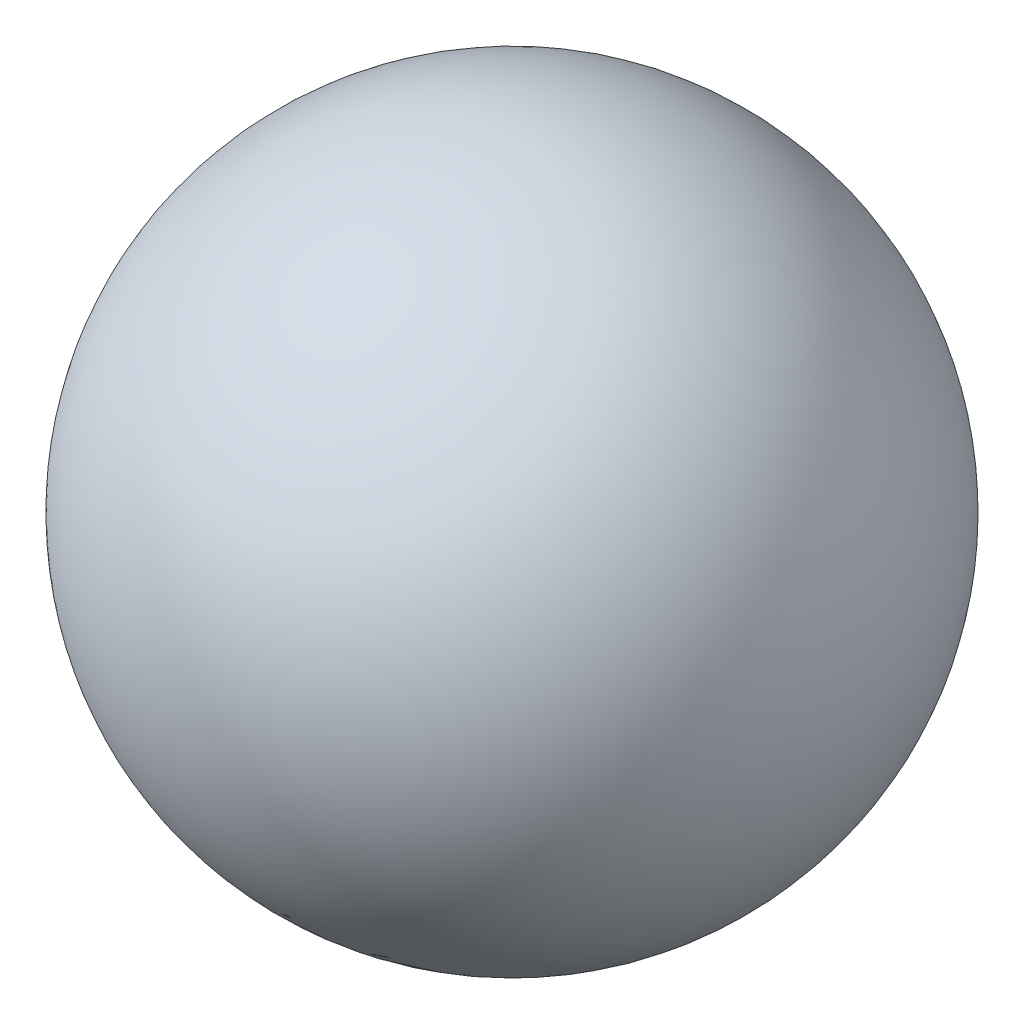
ISO-10303-21;
HEADER;
FILE_DESCRIPTION(('STEP AP214'),'2;1');
FILE_NAME('part.step','',(''),(''),'','','');
FILE_SCHEMA(('AUTOMOTIVE_DESIGN { 1 0 10303 214 1 1 1 1 }'));
ENDSEC;
DATA;
#1=APPLICATION_CONTEXT('core data for automotive mechanical design processes');
#2=APPLICATION_PROTOCOL_DEFINITION('international standard','automotive_design',2000,#1);
#3=PRODUCT_CONTEXT('',#1,'mechanical');
#4=PRODUCT('Part','Part','',(#3));
#5=PRODUCT_RELATED_PRODUCT_CATEGORY('part','',(#4));
#6=PRODUCT_DEFINITION_FORMATION('','',#4);
#7=PRODUCT_DEFINITION_CONTEXT('part definition',#1,'design');
#8=PRODUCT_DEFINITION('design','',#6,#7);
#9=PRODUCT_DEFINITION_SHAPE('','',#8);
#10=(LENGTH_UNIT() NAMED_UNIT(*) SI_UNIT(.MILLI.,.METRE.));
#11=(NAMED_UNIT(*) PLANE_ANGLE_UNIT() SI_UNIT($,.RADIAN.));
#12=(NAMED_UNIT(*) SI_UNIT($,.STERADIAN.) SOLID_ANGLE_UNIT());
#13=UNCERTAINTY_MEASURE_WITH_UNIT(LENGTH_MEASURE(1.E-05),#10,'distance_accuracy_value','');
#14=(GEOMETRIC_REPRESENTATION_CONTEXT(3) GLOBAL_UNCERTAINTY_ASSIGNED_CONTEXT((#13)) GLOBAL_UNIT_ASSIGNED_CONTEXT((#10,
#11,#12)) REPRESENTATION_CONTEXT('',''));
#15=CARTESIAN_POINT('',(0.,0.,0.));
#16=DIRECTION('',(0.,0.,1.));
#17=DIRECTION('',(1.,0.,0.));
#18=AXIS2_PLACEMENT_3D('',#15,#16,#17);
#19=CARTESIAN_POINT('',(64.16,27.0858634108856,63.8776697468443));
#20=DIRECTION('',(0.,0.390381842971417,0.920653038162724));
#21=DIRECTION('',(0.173648177666935,-0.906666249816888,0.384451065593443));
#22=AXIS2_PLACEMENT_3D('',#19,#20,#21);
#23=SPHERICAL_SURFACE('',#22,7.15);
#24=CARTESIAN_POINT('',(64.16,29.8770935881312,70.4603389697077));
#25=VERTEX_POINT('',#24);
#26=VERTEX_LOOP('',#25);
#27=FACE_BOUND('',#26,.T.);
#28=CARTESIAN_POINT('',(64.16,24.29463323364,57.2950005239809));
#29=VERTEX_POINT('',#28);
#30=VERTEX_LOOP('',#29);
#31=FACE_BOUND('',#30,.T.);
#32=ADVANCED_FACE('F15',(#27,#31),#23,.T.);
#33=CLOSED_SHELL('',(#32));
#34=MANIFOLD_SOLID_BREP('B1',#33);
#35=ADVANCED_BREP_SHAPE_REPRESENTATION('',(#18,#34),#14);
#36=SHAPE_DEFINITION_REPRESENTATION(#9,#35);
ENDSEC;
END-ISO-10303-21;
